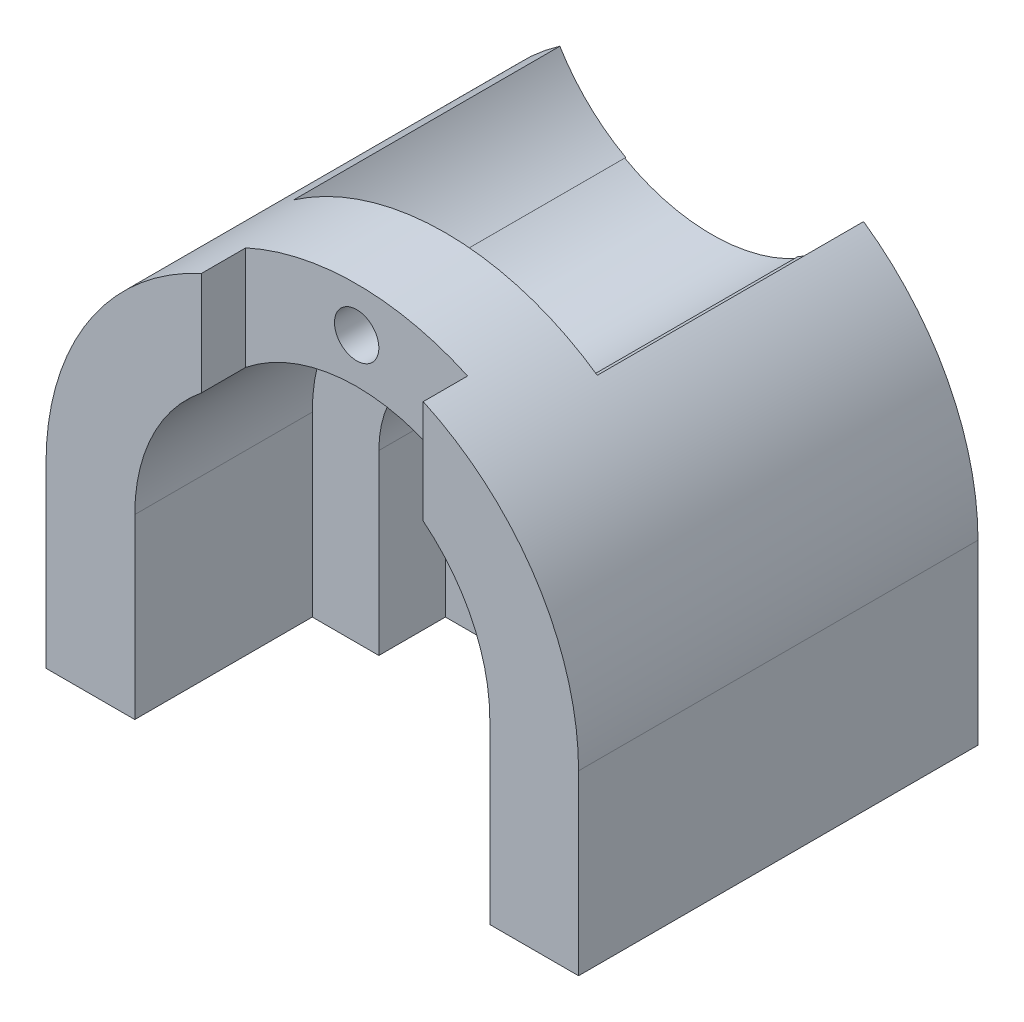
ISO-10303-21;
HEADER;
FILE_DESCRIPTION(('STEP AP214'),'2;1');
FILE_NAME('part.step','',(''),(''),'','','');
FILE_SCHEMA(('AUTOMOTIVE_DESIGN { 1 0 10303 214 1 1 1 1 }'));
ENDSEC;
DATA;
#1=APPLICATION_CONTEXT('core data for automotive mechanical design processes');
#2=APPLICATION_PROTOCOL_DEFINITION('international standard','automotive_design',2000,#1);
#3=PRODUCT_CONTEXT('',#1,'mechanical');
#4=PRODUCT('Part','Part','',(#3));
#5=PRODUCT_RELATED_PRODUCT_CATEGORY('part','',(#4));
#6=PRODUCT_DEFINITION_FORMATION('','',#4);
#7=PRODUCT_DEFINITION_CONTEXT('part definition',#1,'design');
#8=PRODUCT_DEFINITION('design','',#6,#7);
#9=PRODUCT_DEFINITION_SHAPE('','',#8);
#10=(LENGTH_UNIT() NAMED_UNIT(*) SI_UNIT(.MILLI.,.METRE.));
#11=(NAMED_UNIT(*) PLANE_ANGLE_UNIT() SI_UNIT($,.RADIAN.));
#12=(NAMED_UNIT(*) SI_UNIT($,.STERADIAN.) SOLID_ANGLE_UNIT());
#13=UNCERTAINTY_MEASURE_WITH_UNIT(LENGTH_MEASURE(1.E-05),#10,'distance_accuracy_value','');
#14=(GEOMETRIC_REPRESENTATION_CONTEXT(3) GLOBAL_UNCERTAINTY_ASSIGNED_CONTEXT((#13)) GLOBAL_UNIT_ASSIGNED_CONTEXT((#10,
#11,#12)) REPRESENTATION_CONTEXT('',''));
#15=CARTESIAN_POINT('',(0.,0.,0.));
#16=DIRECTION('',(0.,0.,1.));
#17=DIRECTION('',(1.,0.,0.));
#18=AXIS2_PLACEMENT_3D('',#15,#16,#17);
#19=CARTESIAN_POINT('',(0.,0.,20.));
#20=DIRECTION('',(0.,0.,1.));
#21=DIRECTION('',(1.,0.,0.));
#22=AXIS2_PLACEMENT_3D('',#19,#20,#21);
#23=CYLINDRICAL_SURFACE('',#22,25.);
#24=CARTESIAN_POINT('',(0.,0.,20.));
#25=DIRECTION('',(0.,0.,1.));
#26=DIRECTION('',(1.,0.,0.));
#27=AXIS2_PLACEMENT_3D('',#24,#25,#26);
#28=CIRCLE('',#27,25.);
#29=CARTESIAN_POINT('',(25.,0.,20.));
#30=VERTEX_POINT('',#29);
#31=EDGE_CURVE('E284',#30,#30,#28,.T.);
#32=ORIENTED_EDGE('',*,*,#31,.F.);
#33=EDGE_LOOP('',(#32));
#34=FACE_BOUND('',#33,.T.);
#35=CARTESIAN_POINT('',(0.,0.,35.));
#36=DIRECTION('',(0.,0.,1.));
#37=DIRECTION('',(1.,0.,0.));
#38=AXIS2_PLACEMENT_3D('',#35,#36,#37);
#39=CIRCLE('',#38,25.);
#40=CARTESIAN_POINT('',(25.,0.,35.));
#41=VERTEX_POINT('',#40);
#42=CARTESIAN_POINT('',(-25.,0.,35.));
#43=VERTEX_POINT('',#42);
#44=EDGE_CURVE('E215',#41,#43,#39,.F.);
#45=ORIENTED_EDGE('',*,*,#44,.F.);
#46=DIRECTION('',(0.,0.,1.));
#47=VECTOR('',#46,1.);
#48=CARTESIAN_POINT('',(25.,0.,40.));
#49=LINE('',#48,#47);
#50=CARTESIAN_POINT('',(25.,0.,50.));
#51=VERTEX_POINT('',#50);
#52=EDGE_CURVE('E199',#41,#51,#49,.T.);
#53=ORIENTED_EDGE('',*,*,#52,.T.);
#54=CARTESIAN_POINT('',(0.,0.,50.));
#55=DIRECTION('',(0.,0.,1.));
#56=DIRECTION('',(1.,0.,0.));
#57=AXIS2_PLACEMENT_3D('',#54,#55,#56);
#58=CIRCLE('',#57,25.);
#59=CARTESIAN_POINT('',(-25.,0.,50.));
#60=VERTEX_POINT('',#59);
#61=EDGE_CURVE('E275',#60,#51,#58,.F.);
#62=ORIENTED_EDGE('',*,*,#61,.F.);
#63=DIRECTION('',(0.,0.,1.));
#64=VECTOR('',#63,1.);
#65=CARTESIAN_POINT('',(-25.,0.,40.));
#66=LINE('',#65,#64);
#67=EDGE_CURVE('E220',#43,#60,#66,.T.);
#68=ORIENTED_EDGE('',*,*,#67,.F.);
#69=EDGE_LOOP('',(#45,#53,#62,#68));
#70=FACE_BOUND('',#69,.T.);
#71=ADVANCED_FACE('F35',(#34,#70),#23,.F.);
#72=CARTESIAN_POINT('',(0.,35.,60.));
#73=DIRECTION('',(0.,0.,1.));
#74=DIRECTION('',(1.,0.,0.));
#75=AXIS2_PLACEMENT_3D('',#72,#73,#74);
#76=PLANE('',#75);
#77=CARTESIAN_POINT('',(0.,50.,60.));
#78=DIRECTION('',(0.,0.,1.));
#79=DIRECTION('',(1.,0.,0.));
#80=AXIS2_PLACEMENT_3D('',#77,#78,#79);
#81=CIRCLE('',#80,5.);
#82=CARTESIAN_POINT('',(5.,50.,60.));
#83=VERTEX_POINT('',#82);
#84=EDGE_CURVE('E290',#83,#83,#81,.T.);
#85=ORIENTED_EDGE('',*,*,#84,.T.);
#86=EDGE_LOOP('',(#85));
#87=FACE_BOUND('',#86,.T.);
#88=DIRECTION('',(0.,1.,0.));
#89=VECTOR('',#88,1.);
#90=CARTESIAN_POINT('',(20.7813155228472,65.,60.));
#91=LINE('',#90,#89);
#92=CARTESIAN_POINT('',(20.7813155228472,34.1780181569949,60.0000000000005));
#93=VERTEX_POINT('',#92);
#94=CARTESIAN_POINT('',(20.7813155228472,35.8219818430051,59.9999999999996));
#95=VERTEX_POINT('',#94);
#96=EDGE_CURVE('E268',#93,#95,#91,.T.);
#97=ORIENTED_EDGE('',*,*,#96,.F.);
#98=CARTESIAN_POINT('',(0.,0.,60.));
#99=DIRECTION('',(0.,0.,1.));
#100=DIRECTION('',(1.,0.,0.));
#101=AXIS2_PLACEMENT_3D('',#98,#99,#100);
#102=CIRCLE('',#101,40.);
#103=CARTESIAN_POINT('',(-19.3649167310371,35.,60.));
#104=VERTEX_POINT('',#103);
#105=EDGE_CURVE('E264',#104,#93,#102,.F.);
#106=ORIENTED_EDGE('',*,*,#105,.F.);
#107=CARTESIAN_POINT('',(0.,70.,60.));
#108=DIRECTION('',(0.,0.,-1.));
#109=DIRECTION('',(1.,0.,0.));
#110=AXIS2_PLACEMENT_3D('',#107,#108,#109);
#111=CIRCLE('',#110,40.);
#112=CARTESIAN_POINT('',(-34.2186844771528,49.2857142857143,60.));
#113=VERTEX_POINT('',#112);
#114=EDGE_CURVE('E58',#104,#113,#111,.T.);
#115=ORIENTED_EDGE('',*,*,#114,.T.);
#116=CARTESIAN_POINT('',(0.,0.,60.));
#117=DIRECTION('',(0.,0.,-1.));
#118=DIRECTION('',(1.,0.,0.));
#119=AXIS2_PLACEMENT_3D('',#116,#117,#118);
#120=CIRCLE('',#119,60.);
#121=CARTESIAN_POINT('',(34.2186844771528,49.2857142857143,60.));
#122=VERTEX_POINT('',#121);
#123=EDGE_CURVE('E325',#113,#122,#120,.T.);
#124=ORIENTED_EDGE('',*,*,#123,.T.);
#125=EDGE_CURVE('E328',#122,#95,#111,.T.);
#126=ORIENTED_EDGE('',*,*,#125,.T.);
#127=EDGE_LOOP('',(#97,#106,#115,#124,#126));
#128=FACE_BOUND('',#127,.T.);
#129=ADVANCED_FACE('F421',(#87,#128),#76,.F.);
#130=CARTESIAN_POINT('',(25.,87.,80.));
#131=DIRECTION('',(0.,0.,1.));
#132=DIRECTION('',(1.,0.,0.));
#133=AXIS2_PLACEMENT_3D('',#130,#131,#132);
#134=PLANE('',#133);
#135=CARTESIAN_POINT('',(0.,0.,80.));
#136=DIRECTION('',(0.,0.,1.));
#137=DIRECTION('',(1.,0.,0.));
#138=AXIS2_PLACEMENT_3D('',#135,#136,#137);
#139=CIRCLE('',#138,40.);
#140=CARTESIAN_POINT('',(-25.,31.224989991992,80.));
#141=VERTEX_POINT('',#140);
#142=CARTESIAN_POINT('',(25.,31.224989991992,80.));
#143=VERTEX_POINT('',#142);
#144=EDGE_CURVE('E266',#141,#143,#139,.F.);
#145=ORIENTED_EDGE('',*,*,#144,.T.);
#146=DIRECTION('',(0.,-1.,0.));
#147=VECTOR('',#146,1.);
#148=CARTESIAN_POINT('',(25.,87.,80.));
#149=LINE('',#148,#147);
#150=CARTESIAN_POINT('',(25.,54.5435605731786,80.));
#151=VERTEX_POINT('',#150);
#152=EDGE_CURVE('E299',#151,#143,#149,.T.);
#153=ORIENTED_EDGE('',*,*,#152,.F.);
#154=CARTESIAN_POINT('',(0.,0.,80.));
#155=DIRECTION('',(0.,0.,1.));
#156=DIRECTION('',(1.,0.,0.));
#157=AXIS2_PLACEMENT_3D('',#154,#155,#156);
#158=CIRCLE('',#157,60.);
#159=CARTESIAN_POINT('',(-25.,54.5435605731786,80.));
#160=VERTEX_POINT('',#159);
#161=EDGE_CURVE('E378',#160,#151,#158,.F.);
#162=ORIENTED_EDGE('',*,*,#161,.F.);
#163=DIRECTION('',(0.,-1.,0.));
#164=VECTOR('',#163,1.);
#165=CARTESIAN_POINT('',(-25.,87.,80.));
#166=LINE('',#165,#164);
#167=EDGE_CURVE('E50',#160,#141,#166,.T.);
#168=ORIENTED_EDGE('',*,*,#167,.T.);
#169=EDGE_LOOP('',(#145,#153,#162,#168));
#170=FACE_BOUND('',#169,.T.);
#171=CARTESIAN_POINT('',(0.,50.,80.));
#172=DIRECTION('',(0.,0.,1.));
#173=DIRECTION('',(1.,0.,0.));
#174=AXIS2_PLACEMENT_3D('',#171,#172,#173);
#175=CIRCLE('',#174,5.);
#176=CARTESIAN_POINT('',(5.,50.,80.));
#177=VERTEX_POINT('',#176);
#178=EDGE_CURVE('E287',#177,#177,#175,.T.);
#179=ORIENTED_EDGE('',*,*,#178,.F.);
#180=EDGE_LOOP('',(#179));
#181=FACE_BOUND('',#180,.T.);
#182=ADVANCED_FACE('F443',(#170,#181),#134,.T.);
#183=CARTESIAN_POINT('',(0.,70.,60.));
#184=DIRECTION('',(0.,0.,-1.));
#185=DIRECTION('',(-1.,0.,0.));
#186=AXIS2_PLACEMENT_3D('',#183,#184,#185);
#187=CYLINDRICAL_SURFACE('',#186,40.);
#188=DIRECTION('',(0.,0.,1.));
#189=VECTOR('',#188,1.);
#190=CARTESIAN_POINT('',(-19.3649167310371,35.,45.));
#191=LINE('',#190,#189);
#192=CARTESIAN_POINT('',(-19.3649167310371,35.,0.));
#193=VERTEX_POINT('',#192);
#194=EDGE_CURVE('E262',#193,#104,#191,.T.);
#195=ORIENTED_EDGE('',*,*,#194,.F.);
#196=CARTESIAN_POINT('',(0.,70.,0.));
#197=DIRECTION('',(0.,0.,-1.));
#198=DIRECTION('',(1.,0.,0.));
#199=AXIS2_PLACEMENT_3D('',#196,#197,#198);
#200=CIRCLE('',#199,40.);
#201=CARTESIAN_POINT('',(-34.2186844771528,49.2857142857143,0.));
#202=VERTEX_POINT('',#201);
#203=EDGE_CURVE('E324',#193,#202,#200,.T.);
#204=ORIENTED_EDGE('',*,*,#203,.T.);
#205=DIRECTION('',(0.,0.,-1.));
#206=VECTOR('',#205,1.);
#207=CARTESIAN_POINT('',(-34.2186844771528,49.2857142857143,60.));
#208=LINE('',#207,#206);
#209=EDGE_CURVE('E334',#113,#202,#208,.T.);
#210=ORIENTED_EDGE('',*,*,#209,.F.);
#211=ORIENTED_EDGE('',*,*,#114,.F.);
#212=EDGE_LOOP('',(#195,#204,#210,#211));
#213=FACE_BOUND('',#212,.T.);
#214=ADVANCED_FACE('F415',(#213),#187,.F.);
#215=DIRECTION('',(0.,0.,1.));
#216=VECTOR('',#215,1.);
#217=CARTESIAN_POINT('',(19.3649167310371,35.,45.));
#218=LINE('',#217,#216);
#219=CARTESIAN_POINT('',(19.3649167310371,35.,50.));
#220=VERTEX_POINT('',#219);
#221=CARTESIAN_POINT('',(19.3649167310371,35.,0.));
#222=VERTEX_POINT('',#221);
#223=EDGE_CURVE('E258',#220,#222,#218,.F.);
#224=ORIENTED_EDGE('',*,*,#223,.F.);
#225=CARTESIAN_POINT('',(0.,70.,50.));
#226=DIRECTION('',(0.,0.,1.));
#227=DIRECTION('',(1.,0.,0.));
#228=AXIS2_PLACEMENT_3D('',#225,#226,#227);
#229=CIRCLE('',#228,40.);
#230=CARTESIAN_POINT('',(20.7813155228472,35.8219818430051,50.));
#231=VERTEX_POINT('',#230);
#232=EDGE_CURVE('E384',#231,#220,#229,.F.);
#233=ORIENTED_EDGE('',*,*,#232,.F.);
#234=DIRECTION('',(0.,0.,-1.));
#235=VECTOR('',#234,1.);
#236=CARTESIAN_POINT('',(20.7813155228472,35.8219818430051,60.));
#237=LINE('',#236,#235);
#238=EDGE_CURVE('E273',#95,#231,#237,.T.);
#239=ORIENTED_EDGE('',*,*,#238,.F.);
#240=ORIENTED_EDGE('',*,*,#125,.F.);
#241=DIRECTION('',(0.,0.,-1.));
#242=VECTOR('',#241,1.);
#243=CARTESIAN_POINT('',(34.2186844771528,49.2857142857143,60.));
#244=LINE('',#243,#242);
#245=CARTESIAN_POINT('',(34.2186844771528,49.2857142857143,0.));
#246=VERTEX_POINT('',#245);
#247=EDGE_CURVE('E331',#122,#246,#244,.T.);
#248=ORIENTED_EDGE('',*,*,#247,.T.);
#249=EDGE_CURVE('E327',#246,#222,#200,.T.);
#250=ORIENTED_EDGE('',*,*,#249,.T.);
#251=EDGE_LOOP('',(#224,#233,#239,#240,#248,#250));
#252=FACE_BOUND('',#251,.T.);
#253=ADVANCED_FACE('F402',(#252),#187,.F.);
#254=CARTESIAN_POINT('',(0.,0.,0.));
#255=DIRECTION('',(0.,0.,-1.));
#256=DIRECTION('',(-1.,0.,0.));
#257=AXIS2_PLACEMENT_3D('',#254,#255,#256);
#258=PLANE('',#257);
#259=CARTESIAN_POINT('',(0.,0.,0.));
#260=DIRECTION('',(0.,0.,1.));
#261=DIRECTION('',(1.,0.,0.));
#262=AXIS2_PLACEMENT_3D('',#259,#260,#261);
#263=CIRCLE('',#262,10.);
#264=CARTESIAN_POINT('',(10.,0.,0.));
#265=VERTEX_POINT('',#264);
#266=EDGE_CURVE('E361',#265,#265,#263,.T.);
#267=ORIENTED_EDGE('',*,*,#266,.T.);
#268=EDGE_LOOP('',(#267));
#269=FACE_BOUND('',#268,.T.);
#270=CARTESIAN_POINT('',(0.,69.6410161513776,0.));
#271=DIRECTION('',(0.,0.,1.));
#272=DIRECTION('',(1.,0.,0.));
#273=AXIS2_PLACEMENT_3D('',#270,#271,#272);
#274=CIRCLE('',#273,40.);
#275=CARTESIAN_POINT('',(-19.6858379895521,34.8205080756888,0.));
#276=VERTEX_POINT('',#275);
#277=CARTESIAN_POINT('',(19.6858379895521,34.8205080756888,0.));
#278=VERTEX_POINT('',#277);
#279=EDGE_CURVE('E251',#276,#278,#274,.T.);
#280=ORIENTED_EDGE('',*,*,#279,.T.);
#281=CARTESIAN_POINT('',(0.,0.,0.));
#282=DIRECTION('',(0.,0.,1.));
#283=DIRECTION('',(1.,0.,0.));
#284=AXIS2_PLACEMENT_3D('',#281,#282,#283);
#285=CIRCLE('',#284,40.);
#286=EDGE_CURVE('E248',#222,#278,#285,.F.);
#287=ORIENTED_EDGE('',*,*,#286,.F.);
#288=ORIENTED_EDGE('',*,*,#249,.F.);
#289=CARTESIAN_POINT('',(0.,0.,0.));
#290=DIRECTION('',(0.,0.,1.));
#291=DIRECTION('',(-1.,0.,0.));
#292=AXIS2_PLACEMENT_3D('',#289,#290,#291);
#293=CIRCLE('',#292,60.);
#294=CARTESIAN_POINT('',(60.,0.,0.));
#295=VERTEX_POINT('',#294);
#296=EDGE_CURVE('E339',#295,#246,#293,.T.);
#297=ORIENTED_EDGE('',*,*,#296,.F.);
#298=DIRECTION('',(0.,1.,0.));
#299=VECTOR('',#298,1.);
#300=CARTESIAN_POINT('',(60.,0.,0.));
#301=LINE('',#300,#299);
#302=CARTESIAN_POINT('',(60.,-40.,0.));
#303=VERTEX_POINT('',#302);
#304=EDGE_CURVE('E346',#303,#295,#301,.T.);
#305=ORIENTED_EDGE('',*,*,#304,.F.);
#306=DIRECTION('',(1.,0.,0.));
#307=VECTOR('',#306,1.);
#308=CARTESIAN_POINT('',(-40.,-40.,0.));
#309=LINE('',#308,#307);
#310=CARTESIAN_POINT('',(-60.,-40.,0.));
#311=VERTEX_POINT('',#310);
#312=EDGE_CURVE('E369',#311,#303,#309,.T.);
#313=ORIENTED_EDGE('',*,*,#312,.F.);
#314=DIRECTION('',(0.,-1.,0.));
#315=VECTOR('',#314,1.);
#316=CARTESIAN_POINT('',(-60.,0.,0.));
#317=LINE('',#316,#315);
#318=CARTESIAN_POINT('',(-60.,0.,0.));
#319=VERTEX_POINT('',#318);
#320=EDGE_CURVE('E342',#319,#311,#317,.T.);
#321=ORIENTED_EDGE('',*,*,#320,.F.);
#322=EDGE_CURVE('E343',#202,#319,#293,.T.);
#323=ORIENTED_EDGE('',*,*,#322,.F.);
#324=ORIENTED_EDGE('',*,*,#203,.F.);
#325=EDGE_CURVE('E249',#276,#193,#285,.F.);
#326=ORIENTED_EDGE('',*,*,#325,.F.);
#327=EDGE_LOOP('',(#280,#287,#288,#297,#305,#313,#321,#323,#324,#326));
#328=FACE_BOUND('',#327,.T.);
#329=ADVANCED_FACE('F406',(#269,#328),#258,.T.);
#330=CARTESIAN_POINT('',(-19.2186844771528,65.,50.));
#331=DIRECTION('',(0.,0.,1.));
#332=DIRECTION('',(1.,0.,0.));
#333=AXIS2_PLACEMENT_3D('',#330,#331,#332);
#334=PLANE('',#333);
#335=CARTESIAN_POINT('',(0.,0.,50.));
#336=DIRECTION('',(0.,0.,1.));
#337=DIRECTION('',(1.,0.,0.));
#338=AXIS2_PLACEMENT_3D('',#335,#336,#337);
#339=CIRCLE('',#338,40.);
#340=CARTESIAN_POINT('',(19.6858379895521,34.8205080756888,50.));
#341=VERTEX_POINT('',#340);
#342=EDGE_CURVE('E11',#220,#341,#339,.F.);
#343=ORIENTED_EDGE('',*,*,#342,.T.);
#344=CARTESIAN_POINT('',(0.,69.6410161513776,50.));
#345=DIRECTION('',(0.,0.,1.));
#346=DIRECTION('',(1.,0.,0.));
#347=AXIS2_PLACEMENT_3D('',#344,#345,#346);
#348=CIRCLE('',#347,40.);
#349=CARTESIAN_POINT('',(-19.6858379895521,34.8205080756888,50.));
#350=VERTEX_POINT('',#349);
#351=EDGE_CURVE('E43',#350,#341,#348,.T.);
#352=ORIENTED_EDGE('',*,*,#351,.F.);
#353=CARTESIAN_POINT('',(0.,0.,50.));
#354=DIRECTION('',(0.,0.,1.));
#355=DIRECTION('',(-1.,0.,0.));
#356=AXIS2_PLACEMENT_3D('',#353,#354,#355);
#357=CIRCLE('',#356,40.);
#358=CARTESIAN_POINT('',(-40.,-2.79318507107451E-13,50.));
#359=VERTEX_POINT('',#358);
#360=EDGE_CURVE('E234',#350,#359,#357,.T.);
#361=ORIENTED_EDGE('',*,*,#360,.T.);
#362=DIRECTION('',(0.,-1.,0.));
#363=VECTOR('',#362,1.);
#364=CARTESIAN_POINT('',(-40.,-2.79318507107451E-13,50.));
#365=LINE('',#364,#363);
#366=CARTESIAN_POINT('',(-40.,-40.,50.));
#367=VERTEX_POINT('',#366);
#368=EDGE_CURVE('E238',#359,#367,#365,.T.);
#369=ORIENTED_EDGE('',*,*,#368,.T.);
#370=DIRECTION('',(1.,0.,0.));
#371=VECTOR('',#370,1.);
#372=CARTESIAN_POINT('',(-40.,-40.,50.));
#373=LINE('',#372,#371);
#374=CARTESIAN_POINT('',(-25.,-40.,50.));
#375=VERTEX_POINT('',#374);
#376=EDGE_CURVE('E241',#367,#375,#373,.T.);
#377=ORIENTED_EDGE('',*,*,#376,.T.);
#378=DIRECTION('',(0.,1.,0.));
#379=VECTOR('',#378,1.);
#380=CARTESIAN_POINT('',(-25.,-40.,50.));
#381=LINE('',#380,#379);
#382=EDGE_CURVE('E243',#375,#60,#381,.T.);
#383=ORIENTED_EDGE('',*,*,#382,.T.);
#384=ORIENTED_EDGE('',*,*,#61,.T.);
#385=DIRECTION('',(0.,-1.,0.));
#386=VECTOR('',#385,1.);
#387=CARTESIAN_POINT('',(25.,0.,50.));
#388=LINE('',#387,#386);
#389=CARTESIAN_POINT('',(25.,-40.,50.));
#390=VERTEX_POINT('',#389);
#391=EDGE_CURVE('E205',#51,#390,#388,.T.);
#392=ORIENTED_EDGE('',*,*,#391,.T.);
#393=DIRECTION('',(1.,0.,0.));
#394=VECTOR('',#393,1.);
#395=CARTESIAN_POINT('',(25.,-40.,50.));
#396=LINE('',#395,#394);
#397=CARTESIAN_POINT('',(40.,-40.,50.));
#398=VERTEX_POINT('',#397);
#399=EDGE_CURVE('E228',#390,#398,#396,.T.);
#400=ORIENTED_EDGE('',*,*,#399,.T.);
#401=DIRECTION('',(0.,1.,0.));
#402=VECTOR('',#401,1.);
#403=CARTESIAN_POINT('',(40.,-40.,50.));
#404=LINE('',#403,#402);
#405=CARTESIAN_POINT('',(40.,0.,50.));
#406=VERTEX_POINT('',#405);
#407=EDGE_CURVE('E231',#398,#406,#404,.T.);
#408=ORIENTED_EDGE('',*,*,#407,.T.);
#409=CARTESIAN_POINT('',(20.7813155228472,34.1780181569949,50.));
#410=VERTEX_POINT('',#409);
#411=EDGE_CURVE('E235',#406,#410,#357,.T.);
#412=ORIENTED_EDGE('',*,*,#411,.T.);
#413=DIRECTION('',(0.,-1.,0.));
#414=VECTOR('',#413,1.);
#415=CARTESIAN_POINT('',(20.7813155228472,65.,50.));
#416=LINE('',#415,#414);
#417=EDGE_CURVE('E270',#231,#410,#416,.T.);
#418=ORIENTED_EDGE('',*,*,#417,.F.);
#419=ORIENTED_EDGE('',*,*,#232,.T.);
#420=EDGE_LOOP('',(#343,#352,#361,#369,#377,#383,#384,#392,#400,#408,#412,#418,#419));
#421=FACE_BOUND('',#420,.T.);
#422=ADVANCED_FACE('F397',(#421),#334,.T.);
#423=CARTESIAN_POINT('',(20.7813155228472,65.,60.));
#424=DIRECTION('',(-1.,0.,0.));
#425=DIRECTION('',(0.,0.,1.));
#426=AXIS2_PLACEMENT_3D('',#423,#424,#425);
#427=PLANE('',#426);
#428=DIRECTION('',(0.,0.,1.));
#429=VECTOR('',#428,1.);
#430=CARTESIAN_POINT('',(20.7813155228472,34.1780181569949,50.));
#431=LINE('',#430,#429);
#432=EDGE_CURVE('E246',#93,#410,#431,.F.);
#433=ORIENTED_EDGE('',*,*,#432,.F.);
#434=ORIENTED_EDGE('',*,*,#96,.T.);
#435=ORIENTED_EDGE('',*,*,#238,.T.);
#436=ORIENTED_EDGE('',*,*,#417,.T.);
#437=EDGE_LOOP('',(#433,#434,#435,#436));
#438=FACE_BOUND('',#437,.T.);
#439=ADVANCED_FACE('F424',(#438),#427,.T.);
#440=CARTESIAN_POINT('',(0.,0.,90.));
#441=DIRECTION('',(0.,0.,-1.));
#442=DIRECTION('',(-1.,0.,0.));
#443=AXIS2_PLACEMENT_3D('',#440,#441,#442);
#444=CYLINDRICAL_SURFACE('',#443,40.);
#445=DIRECTION('',(0.,0.,-1.));
#446=VECTOR('',#445,1.);
#447=CARTESIAN_POINT('',(25.,31.224989991992,90.));
#448=LINE('',#447,#446);
#449=CARTESIAN_POINT('',(25.,31.224989991992,90.));
#450=VERTEX_POINT('',#449);
#451=EDGE_CURVE('E305',#450,#143,#448,.T.);
#452=ORIENTED_EDGE('',*,*,#451,.T.);
#453=ORIENTED_EDGE('',*,*,#144,.F.);
#454=DIRECTION('',(0.,0.,-1.));
#455=VECTOR('',#454,1.);
#456=CARTESIAN_POINT('',(-25.,31.224989991992,90.));
#457=LINE('',#456,#455);
#458=CARTESIAN_POINT('',(-25.,31.224989991992,90.));
#459=VERTEX_POINT('',#458);
#460=EDGE_CURVE('E302',#141,#459,#457,.F.);
#461=ORIENTED_EDGE('',*,*,#460,.T.);
#462=CARTESIAN_POINT('',(0.,0.,90.));
#463=DIRECTION('',(0.,0.,1.));
#464=DIRECTION('',(-1.,0.,0.));
#465=AXIS2_PLACEMENT_3D('',#462,#463,#464);
#466=CIRCLE('',#465,40.);
#467=CARTESIAN_POINT('',(-40.,0.,90.));
#468=VERTEX_POINT('',#467);
#469=EDGE_CURVE('E308',#459,#468,#466,.T.);
#470=ORIENTED_EDGE('',*,*,#469,.T.);
#471=DIRECTION('',(0.,0.,-1.));
#472=VECTOR('',#471,1.);
#473=CARTESIAN_POINT('',(-40.,0.,90.));
#474=LINE('',#473,#472);
#475=EDGE_CURVE('E322',#468,#359,#474,.T.);
#476=ORIENTED_EDGE('',*,*,#475,.T.);
#477=ORIENTED_EDGE('',*,*,#360,.F.);
#478=DIRECTION('',(0.,0.,1.));
#479=VECTOR('',#478,1.);
#480=CARTESIAN_POINT('',(-19.6858379895521,34.8205080756888,0.));
#481=LINE('',#480,#479);
#482=EDGE_CURVE('E254',#276,#350,#481,.T.);
#483=ORIENTED_EDGE('',*,*,#482,.F.);
#484=ORIENTED_EDGE('',*,*,#325,.T.);
#485=ORIENTED_EDGE('',*,*,#194,.T.);
#486=ORIENTED_EDGE('',*,*,#105,.T.);
#487=ORIENTED_EDGE('',*,*,#432,.T.);
#488=ORIENTED_EDGE('',*,*,#411,.F.);
#489=DIRECTION('',(0.,0.,-1.));
#490=VECTOR('',#489,1.);
#491=CARTESIAN_POINT('',(40.,0.,90.));
#492=LINE('',#491,#490);
#493=CARTESIAN_POINT('',(40.,0.,90.));
#494=VERTEX_POINT('',#493);
#495=EDGE_CURVE('E316',#494,#406,#492,.T.);
#496=ORIENTED_EDGE('',*,*,#495,.F.);
#497=EDGE_CURVE('E309',#494,#450,#466,.T.);
#498=ORIENTED_EDGE('',*,*,#497,.T.);
#499=EDGE_LOOP('',(#452,#453,#461,#470,#476,#477,#483,#484,#485,#486,#487,#488,#496,#498));
#500=FACE_BOUND('',#499,.T.);
#501=ADVANCED_FACE('F413',(#500),#444,.F.);
#502=CARTESIAN_POINT('',(-40.,0.,90.));
#503=DIRECTION('',(1.,0.,0.));
#504=DIRECTION('',(0.,0.,-1.));
#505=AXIS2_PLACEMENT_3D('',#502,#503,#504);
#506=PLANE('',#505);
#507=DIRECTION('',(0.,0.,-1.));
#508=VECTOR('',#507,1.);
#509=CARTESIAN_POINT('',(-40.,-40.,90.));
#510=LINE('',#509,#508);
#511=CARTESIAN_POINT('',(-40.,-40.,90.));
#512=VERTEX_POINT('',#511);
#513=EDGE_CURVE('E320',#512,#367,#510,.T.);
#514=ORIENTED_EDGE('',*,*,#513,.T.);
#515=ORIENTED_EDGE('',*,*,#368,.F.);
#516=ORIENTED_EDGE('',*,*,#475,.F.);
#517=DIRECTION('',(0.,-1.,0.));
#518=VECTOR('',#517,1.);
#519=CARTESIAN_POINT('',(-40.,0.,90.));
#520=LINE('',#519,#518);
#521=EDGE_CURVE('E312',#468,#512,#520,.T.);
#522=ORIENTED_EDGE('',*,*,#521,.T.);
#523=EDGE_LOOP('',(#514,#515,#516,#522));
#524=FACE_BOUND('',#523,.T.);
#525=ADVANCED_FACE('F455',(#524),#506,.T.);
#526=CARTESIAN_POINT('',(40.,0.,90.));
#527=DIRECTION('',(-1.,0.,0.));
#528=DIRECTION('',(0.,0.,1.));
#529=AXIS2_PLACEMENT_3D('',#526,#527,#528);
#530=PLANE('',#529);
#531=ORIENTED_EDGE('',*,*,#495,.T.);
#532=ORIENTED_EDGE('',*,*,#407,.F.);
#533=DIRECTION('',(0.,0.,-1.));
#534=VECTOR('',#533,1.);
#535=CARTESIAN_POINT('',(40.,-40.,90.));
#536=LINE('',#535,#534);
#537=CARTESIAN_POINT('',(40.,-40.,90.));
#538=VERTEX_POINT('',#537);
#539=EDGE_CURVE('E318',#538,#398,#536,.T.);
#540=ORIENTED_EDGE('',*,*,#539,.F.);
#541=DIRECTION('',(0.,1.,0.));
#542=VECTOR('',#541,1.);
#543=CARTESIAN_POINT('',(40.,0.,90.));
#544=LINE('',#543,#542);
#545=EDGE_CURVE('E314',#538,#494,#544,.T.);
#546=ORIENTED_EDGE('',*,*,#545,.T.);
#547=EDGE_LOOP('',(#531,#532,#540,#546));
#548=FACE_BOUND('',#547,.T.);
#549=ADVANCED_FACE('F430',(#548),#530,.T.);
#550=CARTESIAN_POINT('',(0.,0.,0.));
#551=DIRECTION('',(0.,0.,1.));
#552=DIRECTION('',(1.,0.,0.));
#553=AXIS2_PLACEMENT_3D('',#550,#551,#552);
#554=CYLINDRICAL_SURFACE('',#553,10.);
#555=ORIENTED_EDGE('',*,*,#266,.F.);
#556=EDGE_LOOP('',(#555));
#557=FACE_BOUND('',#556,.T.);
#558=CARTESIAN_POINT('',(0.,0.,20.));
#559=DIRECTION('',(0.,0.,1.));
#560=DIRECTION('',(1.,0.,0.));
#561=AXIS2_PLACEMENT_3D('',#558,#559,#560);
#562=CIRCLE('',#561,10.);
#563=CARTESIAN_POINT('',(10.,0.,20.));
#564=VERTEX_POINT('',#563);
#565=EDGE_CURVE('E208',#564,#564,#562,.F.);
#566=ORIENTED_EDGE('',*,*,#565,.F.);
#567=EDGE_LOOP('',(#566));
#568=FACE_BOUND('',#567,.T.);
#569=ADVANCED_FACE('F506',(#557,#568),#554,.F.);
#570=CARTESIAN_POINT('',(0.,0.,90.));
#571=DIRECTION('',(0.,0.,-1.));
#572=DIRECTION('',(-1.,0.,0.));
#573=AXIS2_PLACEMENT_3D('',#570,#571,#572);
#574=PLANE('',#573);
#575=DIRECTION('',(0.,-1.,0.));
#576=VECTOR('',#575,1.);
#577=CARTESIAN_POINT('',(25.,87.,90.));
#578=LINE('',#577,#576);
#579=CARTESIAN_POINT('',(25.,54.5435605731786,90.));
#580=VERTEX_POINT('',#579);
#581=EDGE_CURVE('E293',#580,#450,#578,.T.);
#582=ORIENTED_EDGE('',*,*,#581,.T.);
#583=ORIENTED_EDGE('',*,*,#497,.F.);
#584=ORIENTED_EDGE('',*,*,#545,.F.);
#585=DIRECTION('',(1.,0.,0.));
#586=VECTOR('',#585,1.);
#587=CARTESIAN_POINT('',(-40.,-40.,90.));
#588=LINE('',#587,#586);
#589=CARTESIAN_POINT('',(60.,-40.,90.));
#590=VERTEX_POINT('',#589);
#591=EDGE_CURVE('E374',#538,#590,#588,.T.);
#592=ORIENTED_EDGE('',*,*,#591,.T.);
#593=DIRECTION('',(0.,1.,0.));
#594=VECTOR('',#593,1.);
#595=CARTESIAN_POINT('',(60.,0.,90.));
#596=LINE('',#595,#594);
#597=CARTESIAN_POINT('',(60.,0.,90.));
#598=VERTEX_POINT('',#597);
#599=EDGE_CURVE('E356',#590,#598,#596,.T.);
#600=ORIENTED_EDGE('',*,*,#599,.T.);
#601=CARTESIAN_POINT('',(0.,0.,90.));
#602=DIRECTION('',(0.,0.,1.));
#603=DIRECTION('',(-1.,0.,0.));
#604=AXIS2_PLACEMENT_3D('',#601,#602,#603);
#605=CIRCLE('',#604,60.);
#606=EDGE_CURVE('E350',#598,#580,#605,.T.);
#607=ORIENTED_EDGE('',*,*,#606,.T.);
#608=EDGE_LOOP('',(#582,#583,#584,#592,#600,#607));
#609=FACE_BOUND('',#608,.T.);
#610=ADVANCED_FACE('F434',(#609),#574,.F.);
#611=DIRECTION('',(0.,-1.,0.));
#612=VECTOR('',#611,1.);
#613=CARTESIAN_POINT('',(-25.,87.,90.));
#614=LINE('',#613,#612);
#615=CARTESIAN_POINT('',(-25.,54.5435605731786,90.));
#616=VERTEX_POINT('',#615);
#617=EDGE_CURVE('E296',#616,#459,#614,.T.);
#618=ORIENTED_EDGE('',*,*,#617,.F.);
#619=CARTESIAN_POINT('',(-60.,0.,90.));
#620=VERTEX_POINT('',#619);
#621=EDGE_CURVE('E337',#616,#620,#605,.T.);
#622=ORIENTED_EDGE('',*,*,#621,.T.);
#623=DIRECTION('',(0.,-1.,0.));
#624=VECTOR('',#623,1.);
#625=CARTESIAN_POINT('',(-60.,0.,90.));
#626=LINE('',#625,#624);
#627=CARTESIAN_POINT('',(-60.,-40.,90.));
#628=VERTEX_POINT('',#627);
#629=EDGE_CURVE('E353',#620,#628,#626,.T.);
#630=ORIENTED_EDGE('',*,*,#629,.T.);
#631=EDGE_CURVE('E370',#628,#512,#588,.T.);
#632=ORIENTED_EDGE('',*,*,#631,.T.);
#633=ORIENTED_EDGE('',*,*,#521,.F.);
#634=ORIENTED_EDGE('',*,*,#469,.F.);
#635=EDGE_LOOP('',(#618,#622,#630,#632,#633,#634));
#636=FACE_BOUND('',#635,.T.);
#637=ADVANCED_FACE('F450',(#636),#574,.F.);
#638=CARTESIAN_POINT('',(0.,0.,0.));
#639=DIRECTION('',(0.,0.,1.));
#640=DIRECTION('',(1.,0.,0.));
#641=AXIS2_PLACEMENT_3D('',#638,#639,#640);
#642=CYLINDRICAL_SURFACE('',#641,60.);
#643=DIRECTION('',(0.,0.,1.));
#644=VECTOR('',#643,1.);
#645=CARTESIAN_POINT('',(-60.,0.,0.));
#646=LINE('',#645,#644);
#647=EDGE_CURVE('E349',#319,#620,#646,.T.);
#648=ORIENTED_EDGE('',*,*,#647,.T.);
#649=ORIENTED_EDGE('',*,*,#621,.F.);
#650=DIRECTION('',(0.,0.,1.));
#651=VECTOR('',#650,1.);
#652=CARTESIAN_POINT('',(-25.,54.5435605731786,0.));
#653=LINE('',#652,#651);
#654=EDGE_CURVE('E373',#616,#160,#653,.F.);
#655=ORIENTED_EDGE('',*,*,#654,.T.);
#656=ORIENTED_EDGE('',*,*,#161,.T.);
#657=DIRECTION('',(0.,0.,1.));
#658=VECTOR('',#657,1.);
#659=CARTESIAN_POINT('',(25.,54.5435605731786,0.));
#660=LINE('',#659,#658);
#661=EDGE_CURVE('E381',#151,#580,#660,.T.);
#662=ORIENTED_EDGE('',*,*,#661,.T.);
#663=ORIENTED_EDGE('',*,*,#606,.F.);
#664=DIRECTION('',(0.,0.,1.));
#665=VECTOR('',#664,1.);
#666=CARTESIAN_POINT('',(60.,0.,0.));
#667=LINE('',#666,#665);
#668=EDGE_CURVE('E359',#295,#598,#667,.T.);
#669=ORIENTED_EDGE('',*,*,#668,.F.);
#670=ORIENTED_EDGE('',*,*,#296,.T.);
#671=ORIENTED_EDGE('',*,*,#247,.F.);
#672=ORIENTED_EDGE('',*,*,#123,.F.);
#673=ORIENTED_EDGE('',*,*,#209,.T.);
#674=ORIENTED_EDGE('',*,*,#322,.T.);
#675=EDGE_LOOP('',(#648,#649,#655,#656,#662,#663,#669,#670,#671,#672,#673,#674));
#676=FACE_BOUND('',#675,.T.);
#677=ADVANCED_FACE('F419',(#676),#642,.T.);
#678=CARTESIAN_POINT('',(-40.,-40.,90.));
#679=DIRECTION('',(0.,1.,0.));
#680=DIRECTION('',(0.,0.,1.));
#681=AXIS2_PLACEMENT_3D('',#678,#679,#680);
#682=PLANE('',#681);
#683=DIRECTION('',(0.,0.,1.));
#684=VECTOR('',#683,1.);
#685=CARTESIAN_POINT('',(25.,-40.,40.));
#686=LINE('',#685,#684);
#687=CARTESIAN_POINT('',(25.,-40.,35.));
#688=VERTEX_POINT('',#687);
#689=EDGE_CURVE('E209',#688,#390,#686,.T.);
#690=ORIENTED_EDGE('',*,*,#689,.F.);
#691=DIRECTION('',(1.,0.,0.));
#692=VECTOR('',#691,1.);
#693=CARTESIAN_POINT('',(0.,-40.,35.));
#694=LINE('',#693,#692);
#695=CARTESIAN_POINT('',(-25.,-40.,35.));
#696=VERTEX_POINT('',#695);
#697=EDGE_CURVE('E217',#696,#688,#694,.T.);
#698=ORIENTED_EDGE('',*,*,#697,.F.);
#699=DIRECTION('',(0.,0.,1.));
#700=VECTOR('',#699,1.);
#701=CARTESIAN_POINT('',(-25.,-40.,40.));
#702=LINE('',#701,#700);
#703=EDGE_CURVE('E278',#696,#375,#702,.T.);
#704=ORIENTED_EDGE('',*,*,#703,.T.);
#705=ORIENTED_EDGE('',*,*,#376,.F.);
#706=ORIENTED_EDGE('',*,*,#513,.F.);
#707=ORIENTED_EDGE('',*,*,#631,.F.);
#708=DIRECTION('',(0.,0.,1.));
#709=VECTOR('',#708,1.);
#710=CARTESIAN_POINT('',(-60.,-40.,0.));
#711=LINE('',#710,#709);
#712=EDGE_CURVE('E364',#311,#628,#711,.T.);
#713=ORIENTED_EDGE('',*,*,#712,.F.);
#714=ORIENTED_EDGE('',*,*,#312,.T.);
#715=DIRECTION('',(0.,0.,1.));
#716=VECTOR('',#715,1.);
#717=CARTESIAN_POINT('',(60.,-40.,0.));
#718=LINE('',#717,#716);
#719=EDGE_CURVE('E362',#303,#590,#718,.T.);
#720=ORIENTED_EDGE('',*,*,#719,.T.);
#721=ORIENTED_EDGE('',*,*,#591,.F.);
#722=ORIENTED_EDGE('',*,*,#539,.T.);
#723=ORIENTED_EDGE('',*,*,#399,.F.);
#724=EDGE_LOOP('',(#690,#698,#704,#705,#706,#707,#713,#714,#720,#721,#722,#723));
#725=FACE_BOUND('',#724,.T.);
#726=ADVANCED_FACE('F37',(#725),#682,.F.);
#727=CARTESIAN_POINT('',(60.,0.,0.));
#728=DIRECTION('',(1.,0.,0.));
#729=DIRECTION('',(0.,0.,-1.));
#730=AXIS2_PLACEMENT_3D('',#727,#728,#729);
#731=PLANE('',#730);
#732=ORIENTED_EDGE('',*,*,#668,.T.);
#733=ORIENTED_EDGE('',*,*,#599,.F.);
#734=ORIENTED_EDGE('',*,*,#719,.F.);
#735=ORIENTED_EDGE('',*,*,#304,.T.);
#736=EDGE_LOOP('',(#732,#733,#734,#735));
#737=FACE_BOUND('',#736,.T.);
#738=ADVANCED_FACE('F466',(#737),#731,.T.);
#739=CARTESIAN_POINT('',(-60.,0.,0.));
#740=DIRECTION('',(-1.,0.,0.));
#741=DIRECTION('',(0.,0.,1.));
#742=AXIS2_PLACEMENT_3D('',#739,#740,#741);
#743=PLANE('',#742);
#744=ORIENTED_EDGE('',*,*,#712,.T.);
#745=ORIENTED_EDGE('',*,*,#629,.F.);
#746=ORIENTED_EDGE('',*,*,#647,.F.);
#747=ORIENTED_EDGE('',*,*,#320,.T.);
#748=EDGE_LOOP('',(#744,#745,#746,#747));
#749=FACE_BOUND('',#748,.T.);
#750=ADVANCED_FACE('F472',(#749),#743,.T.);
#751=CARTESIAN_POINT('',(25.,87.,90.));
#752=DIRECTION('',(-1.,0.,0.));
#753=DIRECTION('',(0.,0.,1.));
#754=AXIS2_PLACEMENT_3D('',#751,#752,#753);
#755=PLANE('',#754);
#756=ORIENTED_EDGE('',*,*,#581,.F.);
#757=ORIENTED_EDGE('',*,*,#661,.F.);
#758=ORIENTED_EDGE('',*,*,#152,.T.);
#759=ORIENTED_EDGE('',*,*,#451,.F.);
#760=EDGE_LOOP('',(#756,#757,#758,#759));
#761=FACE_BOUND('',#760,.T.);
#762=ADVANCED_FACE('F439',(#761),#755,.T.);
#763=CARTESIAN_POINT('',(-25.,87.,90.));
#764=DIRECTION('',(1.,0.,0.));
#765=DIRECTION('',(0.,0.,-1.));
#766=AXIS2_PLACEMENT_3D('',#763,#764,#765);
#767=PLANE('',#766);
#768=ORIENTED_EDGE('',*,*,#167,.F.);
#769=ORIENTED_EDGE('',*,*,#654,.F.);
#770=ORIENTED_EDGE('',*,*,#617,.T.);
#771=ORIENTED_EDGE('',*,*,#460,.F.);
#772=EDGE_LOOP('',(#768,#769,#770,#771));
#773=FACE_BOUND('',#772,.T.);
#774=ADVANCED_FACE('F479',(#773),#767,.T.);
#775=CARTESIAN_POINT('',(0.,50.,-6.99999999999999));
#776=DIRECTION('',(0.,0.,1.));
#777=DIRECTION('',(1.,0.,0.));
#778=AXIS2_PLACEMENT_3D('',#775,#776,#777);
#779=CYLINDRICAL_SURFACE('',#778,5.);
#780=ORIENTED_EDGE('',*,*,#178,.T.);
#781=EDGE_LOOP('',(#780));
#782=FACE_BOUND('',#781,.T.);
#783=ORIENTED_EDGE('',*,*,#84,.F.);
#784=EDGE_LOOP('',(#783));
#785=FACE_BOUND('',#784,.T.);
#786=ADVANCED_FACE('F496',(#782,#785),#779,.F.);
#787=CARTESIAN_POINT('',(0.,0.,20.));
#788=DIRECTION('',(0.,0.,1.));
#789=DIRECTION('',(1.,0.,0.));
#790=AXIS2_PLACEMENT_3D('',#787,#788,#789);
#791=PLANE('',#790);
#792=ORIENTED_EDGE('',*,*,#565,.T.);
#793=EDGE_LOOP('',(#792));
#794=FACE_BOUND('',#793,.T.);
#795=ORIENTED_EDGE('',*,*,#31,.T.);
#796=EDGE_LOOP('',(#795));
#797=FACE_BOUND('',#796,.T.);
#798=ADVANCED_FACE('F494',(#794,#797),#791,.T.);
#799=CARTESIAN_POINT('',(25.,0.,40.));
#800=DIRECTION('',(1.,0.,0.));
#801=DIRECTION('',(0.,0.,-1.));
#802=AXIS2_PLACEMENT_3D('',#799,#800,#801);
#803=PLANE('',#802);
#804=ORIENTED_EDGE('',*,*,#689,.T.);
#805=ORIENTED_EDGE('',*,*,#391,.F.);
#806=ORIENTED_EDGE('',*,*,#52,.F.);
#807=DIRECTION('',(0.,1.,0.));
#808=VECTOR('',#807,1.);
#809=CARTESIAN_POINT('',(25.,0.,35.));
#810=LINE('',#809,#808);
#811=EDGE_CURVE('E203',#688,#41,#810,.T.);
#812=ORIENTED_EDGE('',*,*,#811,.F.);
#813=EDGE_LOOP('',(#804,#805,#806,#812));
#814=FACE_BOUND('',#813,.T.);
#815=ADVANCED_FACE('F202',(#814),#803,.F.);
#816=CARTESIAN_POINT('',(-25.,0.,40.));
#817=DIRECTION('',(-1.,0.,0.));
#818=DIRECTION('',(0.,-1.,0.));
#819=AXIS2_PLACEMENT_3D('',#816,#817,#818);
#820=PLANE('',#819);
#821=ORIENTED_EDGE('',*,*,#67,.T.);
#822=ORIENTED_EDGE('',*,*,#382,.F.);
#823=ORIENTED_EDGE('',*,*,#703,.F.);
#824=DIRECTION('',(0.,-1.,0.));
#825=VECTOR('',#824,1.);
#826=CARTESIAN_POINT('',(-25.,0.,35.));
#827=LINE('',#826,#825);
#828=EDGE_CURVE('E222',#43,#696,#827,.T.);
#829=ORIENTED_EDGE('',*,*,#828,.F.);
#830=EDGE_LOOP('',(#821,#822,#823,#829));
#831=FACE_BOUND('',#830,.T.);
#832=ADVANCED_FACE('F462',(#831),#820,.F.);
#833=CARTESIAN_POINT('',(0.,0.,0.));
#834=DIRECTION('',(0.,0.,1.));
#835=DIRECTION('',(1.,0.,0.));
#836=AXIS2_PLACEMENT_3D('',#833,#834,#835);
#837=CYLINDRICAL_SURFACE('',#836,40.);
#838=ORIENTED_EDGE('',*,*,#223,.T.);
#839=ORIENTED_EDGE('',*,*,#286,.T.);
#840=DIRECTION('',(0.,0.,1.));
#841=VECTOR('',#840,1.);
#842=CARTESIAN_POINT('',(19.6858379895521,34.8205080756888,0.));
#843=LINE('',#842,#841);
#844=EDGE_CURVE('E255',#278,#341,#843,.T.);
#845=ORIENTED_EDGE('',*,*,#844,.T.);
#846=ORIENTED_EDGE('',*,*,#342,.F.);
#847=EDGE_LOOP('',(#838,#839,#845,#846));
#848=FACE_BOUND('',#847,.T.);
#849=ADVANCED_FACE('F394',(#848),#837,.F.);
#850=CARTESIAN_POINT('',(0.,69.6410161513776,0.));
#851=DIRECTION('',(0.,0.,1.));
#852=DIRECTION('',(1.,0.,0.));
#853=AXIS2_PLACEMENT_3D('',#850,#851,#852);
#854=CYLINDRICAL_SURFACE('',#853,40.);
#855=ORIENTED_EDGE('',*,*,#482,.T.);
#856=ORIENTED_EDGE('',*,*,#351,.T.);
#857=ORIENTED_EDGE('',*,*,#844,.F.);
#858=ORIENTED_EDGE('',*,*,#279,.F.);
#859=EDGE_LOOP('',(#855,#856,#857,#858));
#860=FACE_BOUND('',#859,.T.);
#861=ADVANCED_FACE('F388',(#860),#854,.F.);
#862=CARTESIAN_POINT('',(0.,0.,35.));
#863=DIRECTION('',(0.,0.,1.));
#864=DIRECTION('',(1.,0.,0.));
#865=AXIS2_PLACEMENT_3D('',#862,#863,#864);
#866=PLANE('',#865);
#867=ORIENTED_EDGE('',*,*,#811,.T.);
#868=ORIENTED_EDGE('',*,*,#44,.T.);
#869=ORIENTED_EDGE('',*,*,#828,.T.);
#870=ORIENTED_EDGE('',*,*,#697,.T.);
#871=EDGE_LOOP('',(#867,#868,#869,#870));
#872=FACE_BOUND('',#871,.T.);
#873=ADVANCED_FACE('F213',(#872),#866,.T.);
#874=CLOSED_SHELL('',(#71,#129,#182,#214,#253,#329,#422,#439,#501,#525,#549,#569,#610,#637,#677,
#726,#738,#750,#762,#774,#786,#798,#815,#832,#849,#861,#873));
#875=MANIFOLD_SOLID_BREP('B2',#874);
#876=ADVANCED_BREP_SHAPE_REPRESENTATION('',(#18,#875),#14);
#877=SHAPE_DEFINITION_REPRESENTATION(#9,#876);
ENDSEC;
END-ISO-10303-21;
